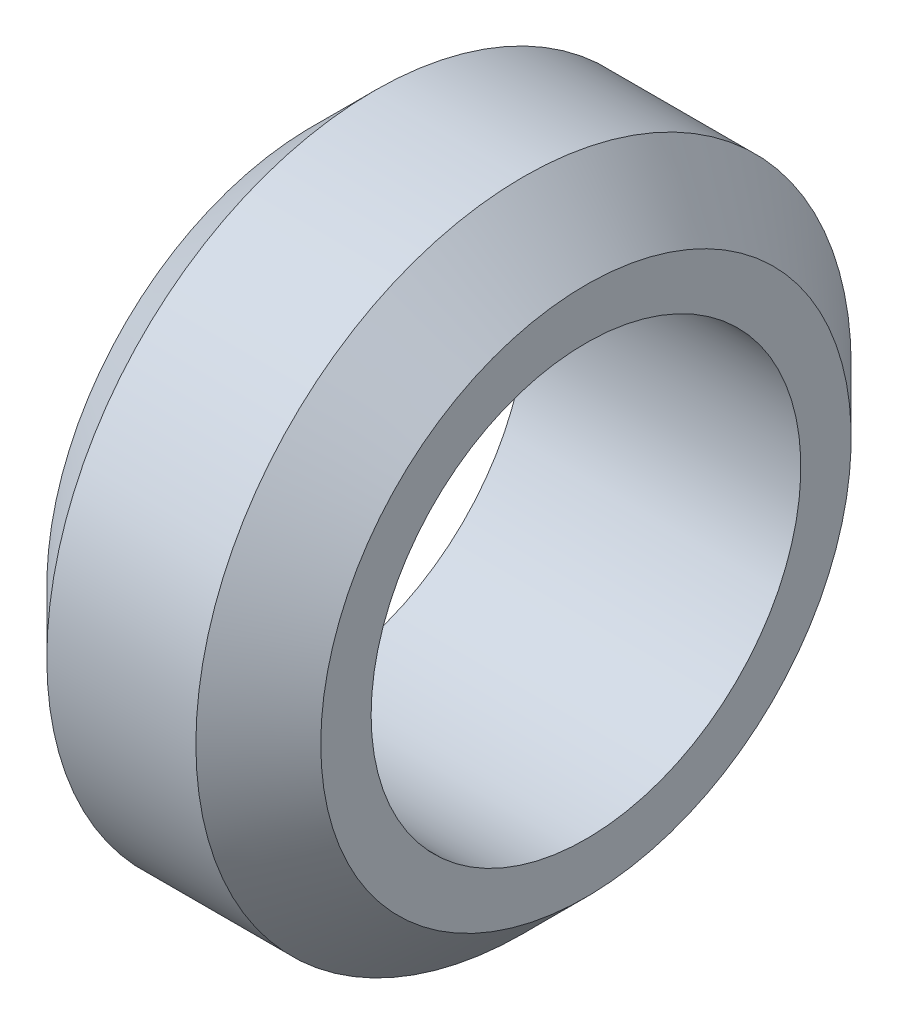
ISO-10303-21;
HEADER;
FILE_DESCRIPTION(('STEP AP214'),'2;1');
FILE_NAME('part.step','',(''),(''),'','','');
FILE_SCHEMA(('AUTOMOTIVE_DESIGN { 1 0 10303 214 1 1 1 1 }'));
ENDSEC;
DATA;
#1=APPLICATION_CONTEXT('core data for automotive mechanical design processes');
#2=APPLICATION_PROTOCOL_DEFINITION('international standard','automotive_design',2000,#1);
#3=PRODUCT_CONTEXT('',#1,'mechanical');
#4=PRODUCT('Part','Part','',(#3));
#5=PRODUCT_RELATED_PRODUCT_CATEGORY('part','',(#4));
#6=PRODUCT_DEFINITION_FORMATION('','',#4);
#7=PRODUCT_DEFINITION_CONTEXT('part definition',#1,'design');
#8=PRODUCT_DEFINITION('design','',#6,#7);
#9=PRODUCT_DEFINITION_SHAPE('','',#8);
#10=(LENGTH_UNIT() NAMED_UNIT(*) SI_UNIT(.MILLI.,.METRE.));
#11=(NAMED_UNIT(*) PLANE_ANGLE_UNIT() SI_UNIT($,.RADIAN.));
#12=(NAMED_UNIT(*) SI_UNIT($,.STERADIAN.) SOLID_ANGLE_UNIT());
#13=UNCERTAINTY_MEASURE_WITH_UNIT(LENGTH_MEASURE(1.E-05),#10,'distance_accuracy_value','');
#14=(GEOMETRIC_REPRESENTATION_CONTEXT(3) GLOBAL_UNCERTAINTY_ASSIGNED_CONTEXT((#13)) GLOBAL_UNIT_ASSIGNED_CONTEXT((#10,
#11,#12)) REPRESENTATION_CONTEXT('',''));
#15=CARTESIAN_POINT('',(0.,0.,0.));
#16=DIRECTION('',(0.,0.,1.));
#17=DIRECTION('',(1.,0.,0.));
#18=AXIS2_PLACEMENT_3D('',#15,#16,#17);
#19=CARTESIAN_POINT('',(0.,0.,0.));
#20=DIRECTION('',(-1.,0.,0.));
#21=DIRECTION('',(0.,0.,1.));
#22=AXIS2_PLACEMENT_3D('',#19,#20,#21);
#23=CYLINDRICAL_SURFACE('',#22,12.2);
#24=CARTESIAN_POINT('',(2.775,0.,0.));
#25=DIRECTION('',(-1.,0.,0.));
#26=DIRECTION('',(0.,0.,1.));
#27=AXIS2_PLACEMENT_3D('',#24,#25,#26);
#28=CIRCLE('',#27,12.2);
#29=CARTESIAN_POINT('',(2.775,0.,12.2));
#30=VERTEX_POINT('',#29);
#31=EDGE_CURVE('E36',#30,#30,#28,.F.);
#32=ORIENTED_EDGE('',*,*,#31,.F.);
#33=EDGE_LOOP('',(#32));
#34=FACE_BOUND('',#33,.T.);
#35=CARTESIAN_POINT('',(-2.775,0.,0.));
#36=DIRECTION('',(1.,0.,0.));
#37=DIRECTION('',(0.,0.,-1.));
#38=AXIS2_PLACEMENT_3D('',#35,#36,#37);
#39=CIRCLE('',#38,12.2);
#40=CARTESIAN_POINT('',(-2.775,0.,-12.2));
#41=VERTEX_POINT('',#40);
#42=EDGE_CURVE('E30',#41,#41,#39,.F.);
#43=ORIENTED_EDGE('',*,*,#42,.F.);
#44=EDGE_LOOP('',(#43));
#45=FACE_BOUND('',#44,.T.);
#46=ADVANCED_FACE('F15',(#34,#45),#23,.T.);
#47=CARTESIAN_POINT('',(-2.775,0.,0.));
#48=DIRECTION('',(1.,0.,0.));
#49=DIRECTION('',(0.,0.,-1.));
#50=AXIS2_PLACEMENT_3D('',#47,#48,#49);
#51=CONICAL_SURFACE('',#50,12.2,0.78539816339745);
#52=CARTESIAN_POINT('',(-5.1,0.,0.));
#53=DIRECTION('',(1.,0.,0.));
#54=DIRECTION('',(0.,0.,-1.));
#55=AXIS2_PLACEMENT_3D('',#52,#53,#54);
#56=CIRCLE('',#55,9.875);
#57=CARTESIAN_POINT('',(-5.1,0.,-9.875));
#58=VERTEX_POINT('',#57);
#59=EDGE_CURVE('E18',#58,#58,#56,.T.);
#60=ORIENTED_EDGE('',*,*,#59,.T.);
#61=EDGE_LOOP('',(#60));
#62=FACE_BOUND('',#61,.T.);
#63=ORIENTED_EDGE('',*,*,#42,.T.);
#64=EDGE_LOOP('',(#63));
#65=FACE_BOUND('',#64,.T.);
#66=ADVANCED_FACE('F45',(#62,#65),#51,.T.);
#67=CARTESIAN_POINT('',(2.775,0.,0.));
#68=DIRECTION('',(-1.,0.,0.));
#69=DIRECTION('',(0.,0.,1.));
#70=AXIS2_PLACEMENT_3D('',#67,#68,#69);
#71=CONICAL_SURFACE('',#70,12.2,0.785398163397449);
#72=CARTESIAN_POINT('',(5.1,0.,0.));
#73=DIRECTION('',(-1.,0.,0.));
#74=DIRECTION('',(0.,0.,1.));
#75=AXIS2_PLACEMENT_3D('',#72,#73,#74);
#76=CIRCLE('',#75,9.875);
#77=CARTESIAN_POINT('',(5.1,0.,9.875));
#78=VERTEX_POINT('',#77);
#79=EDGE_CURVE('E27',#78,#78,#76,.F.);
#80=ORIENTED_EDGE('',*,*,#79,.F.);
#81=EDGE_LOOP('',(#80));
#82=FACE_BOUND('',#81,.T.);
#83=ORIENTED_EDGE('',*,*,#31,.T.);
#84=EDGE_LOOP('',(#83));
#85=FACE_BOUND('',#84,.T.);
#86=ADVANCED_FACE('F53',(#82,#85),#71,.T.);
#87=CARTESIAN_POINT('',(-5.1,0.,0.));
#88=DIRECTION('',(1.,0.,0.));
#89=DIRECTION('',(0.,0.,-1.));
#90=AXIS2_PLACEMENT_3D('',#87,#88,#89);
#91=PLANE('',#90);
#92=CARTESIAN_POINT('',(-5.1,0.,0.));
#93=DIRECTION('',(-1.,0.,0.));
#94=DIRECTION('',(0.,0.,1.));
#95=AXIS2_PLACEMENT_3D('',#92,#93,#94);
#96=CIRCLE('',#95,8.);
#97=CARTESIAN_POINT('',(-5.1,0.,8.));
#98=VERTEX_POINT('',#97);
#99=EDGE_CURVE('E22',#98,#98,#96,.F.);
#100=ORIENTED_EDGE('',*,*,#99,.T.);
#101=EDGE_LOOP('',(#100));
#102=FACE_BOUND('',#101,.T.);
#103=ORIENTED_EDGE('',*,*,#59,.F.);
#104=EDGE_LOOP('',(#103));
#105=FACE_BOUND('',#104,.T.);
#106=ADVANCED_FACE('F62',(#102,#105),#91,.F.);
#107=CARTESIAN_POINT('',(5.1,0.,0.));
#108=DIRECTION('',(1.,0.,0.));
#109=DIRECTION('',(0.,0.,-1.));
#110=AXIS2_PLACEMENT_3D('',#107,#108,#109);
#111=PLANE('',#110);
#112=CARTESIAN_POINT('',(5.1,0.,0.));
#113=DIRECTION('',(-1.,0.,0.));
#114=DIRECTION('',(0.,0.,1.));
#115=AXIS2_PLACEMENT_3D('',#112,#113,#114);
#116=CIRCLE('',#115,8.);
#117=CARTESIAN_POINT('',(5.1,0.,8.));
#118=VERTEX_POINT('',#117);
#119=EDGE_CURVE('E10',#118,#118,#116,.T.);
#120=ORIENTED_EDGE('',*,*,#119,.T.);
#121=EDGE_LOOP('',(#120));
#122=FACE_BOUND('',#121,.T.);
#123=ORIENTED_EDGE('',*,*,#79,.T.);
#124=EDGE_LOOP('',(#123));
#125=FACE_BOUND('',#124,.T.);
#126=ADVANCED_FACE('F56',(#122,#125),#111,.T.);
#127=CARTESIAN_POINT('',(0.,0.,0.));
#128=DIRECTION('',(-1.,0.,0.));
#129=DIRECTION('',(0.,0.,1.));
#130=AXIS2_PLACEMENT_3D('',#127,#128,#129);
#131=CYLINDRICAL_SURFACE('',#130,8.);
#132=ORIENTED_EDGE('',*,*,#99,.F.);
#133=EDGE_LOOP('',(#132));
#134=FACE_BOUND('',#133,.T.);
#135=ORIENTED_EDGE('',*,*,#119,.F.);
#136=EDGE_LOOP('',(#135));
#137=FACE_BOUND('',#136,.T.);
#138=ADVANCED_FACE('F54',(#134,#137),#131,.F.);
#139=CLOSED_SHELL('',(#46,#66,#86,#106,#126,#138));
#140=MANIFOLD_SOLID_BREP('B1',#139);
#141=ADVANCED_BREP_SHAPE_REPRESENTATION('',(#18,#140),#14);
#142=SHAPE_DEFINITION_REPRESENTATION(#9,#141);
ENDSEC;
END-ISO-10303-21;
